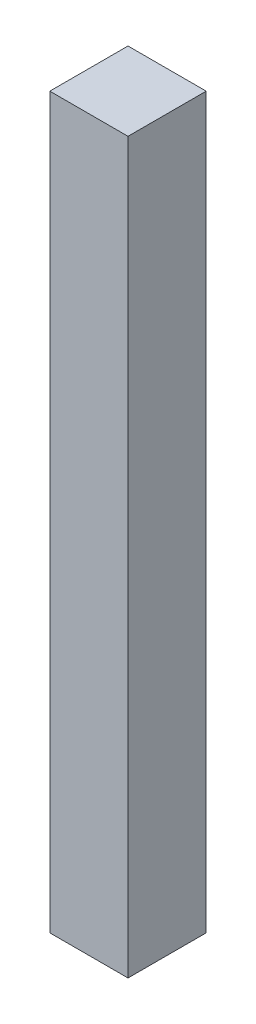
ISO-10303-21;
HEADER;
FILE_DESCRIPTION(('STEP AP214'),'2;1');
FILE_NAME('part.step','',(''),(''),'','','');
FILE_SCHEMA(('AUTOMOTIVE_DESIGN { 1 0 10303 214 1 1 1 1 }'));
ENDSEC;
DATA;
#1=APPLICATION_CONTEXT('core data for automotive mechanical design processes');
#2=APPLICATION_PROTOCOL_DEFINITION('international standard','automotive_design',2000,#1);
#3=PRODUCT_CONTEXT('',#1,'mechanical');
#4=PRODUCT('Part','Part','',(#3));
#5=PRODUCT_RELATED_PRODUCT_CATEGORY('part','',(#4));
#6=PRODUCT_DEFINITION_FORMATION('','',#4);
#7=PRODUCT_DEFINITION_CONTEXT('part definition',#1,'design');
#8=PRODUCT_DEFINITION('design','',#6,#7);
#9=PRODUCT_DEFINITION_SHAPE('','',#8);
#10=(LENGTH_UNIT() NAMED_UNIT(*) SI_UNIT(.MILLI.,.METRE.));
#11=(NAMED_UNIT(*) PLANE_ANGLE_UNIT() SI_UNIT($,.RADIAN.));
#12=(NAMED_UNIT(*) SI_UNIT($,.STERADIAN.) SOLID_ANGLE_UNIT());
#13=UNCERTAINTY_MEASURE_WITH_UNIT(LENGTH_MEASURE(1.E-05),#10,'distance_accuracy_value','');
#14=(GEOMETRIC_REPRESENTATION_CONTEXT(3) GLOBAL_UNCERTAINTY_ASSIGNED_CONTEXT((#13)) GLOBAL_UNIT_ASSIGNED_CONTEXT((#10,
#11,#12)) REPRESENTATION_CONTEXT('',''));
#15=CARTESIAN_POINT('',(0.,0.,0.));
#16=DIRECTION('',(0.,0.,1.));
#17=DIRECTION('',(1.,0.,0.));
#18=AXIS2_PLACEMENT_3D('',#15,#16,#17);
#19=CARTESIAN_POINT('',(508.,-828.675,-1016.));
#20=DIRECTION('',(-1.,0.,0.));
#21=DIRECTION('',(0.,0.,1.));
#22=AXIS2_PLACEMENT_3D('',#19,#20,#21);
#23=PLANE('',#22);
#24=DIRECTION('',(0.,0.,1.));
#25=VECTOR('',#24,1.);
#26=CARTESIAN_POINT('',(508.,0.,-1016.));
#27=LINE('',#26,#25);
#28=CARTESIAN_POINT('',(508.,0.,-1016.));
#29=VERTEX_POINT('',#28);
#30=CARTESIAN_POINT('',(508.,0.,-927.1));
#31=VERTEX_POINT('',#30);
#32=EDGE_CURVE('E96',#29,#31,#27,.T.);
#33=ORIENTED_EDGE('',*,*,#32,.T.);
#34=DIRECTION('',(0.,1.,0.));
#35=VECTOR('',#34,1.);
#36=CARTESIAN_POINT('',(508.,-828.675,-927.1));
#37=LINE('',#36,#35);
#38=CARTESIAN_POINT('',(508.,-828.675,-927.1));
#39=VERTEX_POINT('',#38);
#40=EDGE_CURVE('E11',#39,#31,#37,.T.);
#41=ORIENTED_EDGE('',*,*,#40,.F.);
#42=DIRECTION('',(0.,0.,1.));
#43=VECTOR('',#42,1.);
#44=CARTESIAN_POINT('',(508.,-828.675,-1016.));
#45=LINE('',#44,#43);
#46=CARTESIAN_POINT('',(508.,-828.675,-1016.));
#47=VERTEX_POINT('',#46);
#48=EDGE_CURVE('E105',#47,#39,#45,.T.);
#49=ORIENTED_EDGE('',*,*,#48,.F.);
#50=DIRECTION('',(0.,1.,0.));
#51=VECTOR('',#50,1.);
#52=CARTESIAN_POINT('',(508.,-828.675,-1016.));
#53=LINE('',#52,#51);
#54=EDGE_CURVE('E110',#47,#29,#53,.T.);
#55=ORIENTED_EDGE('',*,*,#54,.T.);
#56=EDGE_LOOP('',(#33,#41,#49,#55));
#57=FACE_BOUND('',#56,.T.);
#58=ADVANCED_FACE('F38',(#57),#23,.F.);
#59=CARTESIAN_POINT('',(508.,-828.675,-927.1));
#60=DIRECTION('',(0.,0.,-1.));
#61=DIRECTION('',(-1.,0.,0.));
#62=AXIS2_PLACEMENT_3D('',#59,#60,#61);
#63=PLANE('',#62);
#64=DIRECTION('',(-1.,0.,0.));
#65=VECTOR('',#64,1.);
#66=CARTESIAN_POINT('',(508.,0.,-927.1));
#67=LINE('',#66,#65);
#68=CARTESIAN_POINT('',(419.1,0.,-927.1));
#69=VERTEX_POINT('',#68);
#70=EDGE_CURVE('E100',#31,#69,#67,.T.);
#71=ORIENTED_EDGE('',*,*,#70,.T.);
#72=DIRECTION('',(0.,1.,0.));
#73=VECTOR('',#72,1.);
#74=CARTESIAN_POINT('',(419.1,-828.675,-927.1));
#75=LINE('',#74,#73);
#76=CARTESIAN_POINT('',(419.1,-828.675,-927.1));
#77=VERTEX_POINT('',#76);
#78=EDGE_CURVE('E46',#77,#69,#75,.T.);
#79=ORIENTED_EDGE('',*,*,#78,.F.);
#80=DIRECTION('',(-1.,0.,0.));
#81=VECTOR('',#80,1.);
#82=CARTESIAN_POINT('',(508.,-828.675,-927.1));
#83=LINE('',#82,#81);
#84=EDGE_CURVE('E81',#39,#77,#83,.T.);
#85=ORIENTED_EDGE('',*,*,#84,.F.);
#86=ORIENTED_EDGE('',*,*,#40,.T.);
#87=EDGE_LOOP('',(#71,#79,#85,#86));
#88=FACE_BOUND('',#87,.T.);
#89=ADVANCED_FACE('F124',(#88),#63,.F.);
#90=CARTESIAN_POINT('',(419.1,-828.675,-1016.));
#91=DIRECTION('',(1.,0.,0.));
#92=DIRECTION('',(0.,0.,-1.));
#93=AXIS2_PLACEMENT_3D('',#90,#91,#92);
#94=PLANE('',#93);
#95=DIRECTION('',(0.,0.,-1.));
#96=VECTOR('',#95,1.);
#97=CARTESIAN_POINT('',(419.1,0.,-1016.));
#98=LINE('',#97,#96);
#99=CARTESIAN_POINT('',(419.1,0.,-1016.));
#100=VERTEX_POINT('',#99);
#101=EDGE_CURVE('E114',#69,#100,#98,.T.);
#102=ORIENTED_EDGE('',*,*,#101,.T.);
#103=DIRECTION('',(0.,1.,0.));
#104=VECTOR('',#103,1.);
#105=CARTESIAN_POINT('',(419.1,-828.675,-1016.));
#106=LINE('',#105,#104);
#107=CARTESIAN_POINT('',(419.1,-828.675,-1016.));
#108=VERTEX_POINT('',#107);
#109=EDGE_CURVE('E119',#108,#100,#106,.T.);
#110=ORIENTED_EDGE('',*,*,#109,.F.);
#111=DIRECTION('',(0.,0.,-1.));
#112=VECTOR('',#111,1.);
#113=CARTESIAN_POINT('',(419.1,-828.675,-1016.));
#114=LINE('',#113,#112);
#115=EDGE_CURVE('E108',#77,#108,#114,.T.);
#116=ORIENTED_EDGE('',*,*,#115,.F.);
#117=ORIENTED_EDGE('',*,*,#78,.T.);
#118=EDGE_LOOP('',(#102,#110,#116,#117));
#119=FACE_BOUND('',#118,.T.);
#120=ADVANCED_FACE('F122',(#119),#94,.F.);
#121=CARTESIAN_POINT('',(508.,-828.675,-1016.));
#122=DIRECTION('',(0.,0.,1.));
#123=DIRECTION('',(1.,0.,0.));
#124=AXIS2_PLACEMENT_3D('',#121,#122,#123);
#125=PLANE('',#124);
#126=DIRECTION('',(1.,0.,0.));
#127=VECTOR('',#126,1.);
#128=CARTESIAN_POINT('',(508.,0.,-1016.));
#129=LINE('',#128,#127);
#130=EDGE_CURVE('E71',#100,#29,#129,.T.);
#131=ORIENTED_EDGE('',*,*,#130,.T.);
#132=ORIENTED_EDGE('',*,*,#54,.F.);
#133=DIRECTION('',(1.,0.,0.));
#134=VECTOR('',#133,1.);
#135=CARTESIAN_POINT('',(508.,-828.675,-1016.));
#136=LINE('',#135,#134);
#137=EDGE_CURVE('E54',#108,#47,#136,.T.);
#138=ORIENTED_EDGE('',*,*,#137,.F.);
#139=ORIENTED_EDGE('',*,*,#109,.T.);
#140=EDGE_LOOP('',(#131,#132,#138,#139));
#141=FACE_BOUND('',#140,.T.);
#142=ADVANCED_FACE('F128',(#141),#125,.F.);
#143=CARTESIAN_POINT('',(0.,-828.675,0.));
#144=DIRECTION('',(0.,-1.,0.));
#145=DIRECTION('',(0.,0.,1.));
#146=AXIS2_PLACEMENT_3D('',#143,#144,#145);
#147=PLANE('',#146);
#148=CARTESIAN_POINT('',(463.55,-828.675,-971.55));
#149=DIRECTION('',(0.,-1.,0.));
#150=DIRECTION('',(0.,0.,1.));
#151=AXIS2_PLACEMENT_3D('',#148,#149,#150);
#152=CIRCLE('',#151,6.35000000000002);
#153=CARTESIAN_POINT('',(463.55,-828.675,-965.2));
#154=VERTEX_POINT('',#153);
#155=EDGE_CURVE('E97',#154,#154,#152,.T.);
#156=ORIENTED_EDGE('',*,*,#155,.F.);
#157=EDGE_LOOP('',(#156));
#158=FACE_BOUND('',#157,.T.);
#159=ORIENTED_EDGE('',*,*,#48,.T.);
#160=ORIENTED_EDGE('',*,*,#84,.T.);
#161=ORIENTED_EDGE('',*,*,#115,.T.);
#162=ORIENTED_EDGE('',*,*,#137,.T.);
#163=EDGE_LOOP('',(#159,#160,#161,#162));
#164=FACE_BOUND('',#163,.T.);
#165=ADVANCED_FACE('F129',(#158,#164),#147,.T.);
#166=CARTESIAN_POINT('',(0.,0.,0.));
#167=DIRECTION('',(0.,-1.,0.));
#168=DIRECTION('',(0.,0.,1.));
#169=AXIS2_PLACEMENT_3D('',#166,#167,#168);
#170=PLANE('',#169);
#171=ORIENTED_EDGE('',*,*,#32,.F.);
#172=ORIENTED_EDGE('',*,*,#130,.F.);
#173=ORIENTED_EDGE('',*,*,#101,.F.);
#174=ORIENTED_EDGE('',*,*,#70,.F.);
#175=EDGE_LOOP('',(#171,#172,#173,#174));
#176=FACE_BOUND('',#175,.T.);
#177=ADVANCED_FACE('F90',(#176),#170,.F.);
#178=CARTESIAN_POINT('',(463.55,-824.611,-971.55));
#179=DIRECTION('',(0.,-1.,0.));
#180=DIRECTION('',(0.,0.,1.));
#181=AXIS2_PLACEMENT_3D('',#178,#179,#180);
#182=CONICAL_SURFACE('',#181,6.35000000000002,1.02974425867665);
#183=CARTESIAN_POINT('',(463.55,-820.795535069175,-971.55));
#184=VERTEX_POINT('',#183);
#185=VERTEX_LOOP('',#184);
#186=FACE_BOUND('',#185,.T.);
#187=CARTESIAN_POINT('',(463.55,-824.611,-971.55));
#188=DIRECTION('',(0.,-1.,0.));
#189=DIRECTION('',(0.,0.,1.));
#190=AXIS2_PLACEMENT_3D('',#187,#188,#189);
#191=CIRCLE('',#190,6.35000000000002);
#192=CARTESIAN_POINT('',(463.55,-824.611,-965.2));
#193=VERTEX_POINT('',#192);
#194=EDGE_CURVE('E94',#193,#193,#191,.T.);
#195=ORIENTED_EDGE('',*,*,#194,.T.);
#196=EDGE_LOOP('',(#195));
#197=FACE_BOUND('',#196,.T.);
#198=ADVANCED_FACE('F86',(#186,#197),#182,.F.);
#199=CARTESIAN_POINT('',(463.55,-828.675,-971.55));
#200=DIRECTION('',(0.,-1.,0.));
#201=DIRECTION('',(0.,0.,1.));
#202=AXIS2_PLACEMENT_3D('',#199,#200,#201);
#203=CYLINDRICAL_SURFACE('',#202,6.35000000000002);
#204=ORIENTED_EDGE('',*,*,#194,.F.);
#205=EDGE_LOOP('',(#204));
#206=FACE_BOUND('',#205,.T.);
#207=ORIENTED_EDGE('',*,*,#155,.T.);
#208=EDGE_LOOP('',(#207));
#209=FACE_BOUND('',#208,.T.);
#210=ADVANCED_FACE('F89',(#206,#209),#203,.F.);
#211=CLOSED_SHELL('',(#58,#89,#120,#142,#165,#177,#198,#210));
#212=MANIFOLD_SOLID_BREP('B2',#211);
#213=ADVANCED_BREP_SHAPE_REPRESENTATION('',(#18,#212),#14);
#214=SHAPE_DEFINITION_REPRESENTATION(#9,#213);
ENDSEC;
END-ISO-10303-21;
